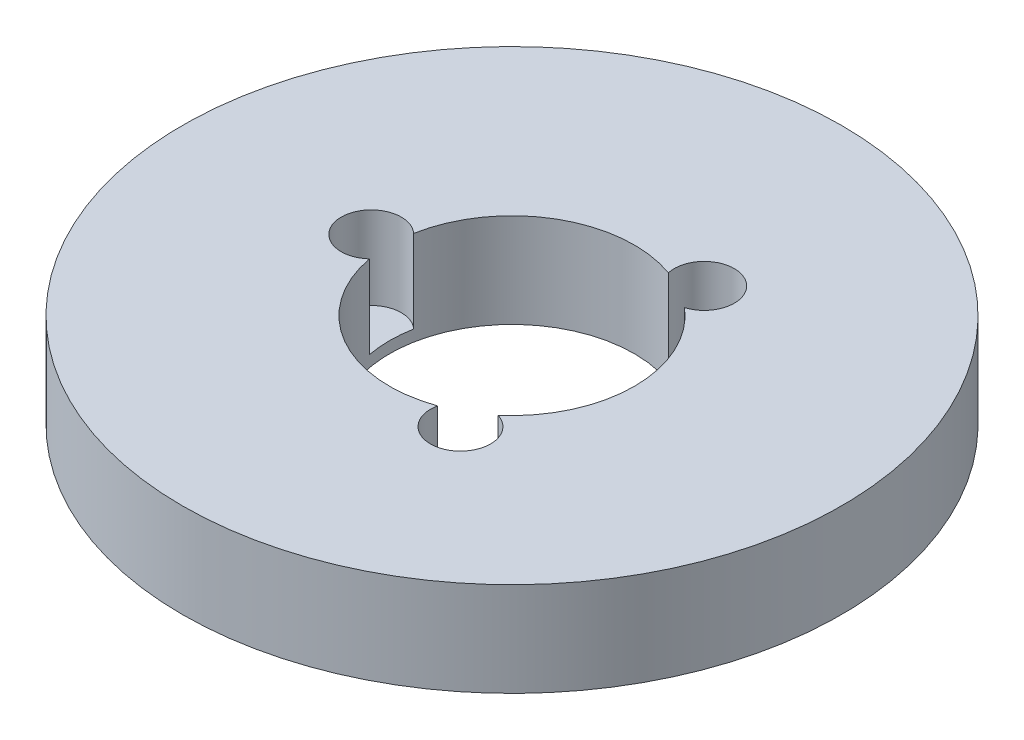
ISO-10303-21;
HEADER;
FILE_DESCRIPTION(('STEP AP214'),'2;1');
FILE_NAME('part.step','',(''),(''),'','','');
FILE_SCHEMA(('AUTOMOTIVE_DESIGN { 1 0 10303 214 1 1 1 1 }'));
ENDSEC;
DATA;
#1=APPLICATION_CONTEXT('core data for automotive mechanical design processes');
#2=APPLICATION_PROTOCOL_DEFINITION('international standard','automotive_design',2000,#1);
#3=PRODUCT_CONTEXT('',#1,'mechanical');
#4=PRODUCT('Part','Part','',(#3));
#5=PRODUCT_RELATED_PRODUCT_CATEGORY('part','',(#4));
#6=PRODUCT_DEFINITION_FORMATION('','',#4);
#7=PRODUCT_DEFINITION_CONTEXT('part definition',#1,'design');
#8=PRODUCT_DEFINITION('design','',#6,#7);
#9=PRODUCT_DEFINITION_SHAPE('','',#8);
#10=(LENGTH_UNIT() NAMED_UNIT(*) SI_UNIT(.MILLI.,.METRE.));
#11=(NAMED_UNIT(*) PLANE_ANGLE_UNIT() SI_UNIT($,.RADIAN.));
#12=(NAMED_UNIT(*) SI_UNIT($,.STERADIAN.) SOLID_ANGLE_UNIT());
#13=UNCERTAINTY_MEASURE_WITH_UNIT(LENGTH_MEASURE(1.E-05),#10,'distance_accuracy_value','');
#14=(GEOMETRIC_REPRESENTATION_CONTEXT(3) GLOBAL_UNCERTAINTY_ASSIGNED_CONTEXT((#13)) GLOBAL_UNIT_ASSIGNED_CONTEXT((#10,
#11,#12)) REPRESENTATION_CONTEXT('',''));
#15=CARTESIAN_POINT('',(0.,0.,0.));
#16=DIRECTION('',(0.,0.,1.));
#17=DIRECTION('',(1.,0.,0.));
#18=AXIS2_PLACEMENT_3D('',#15,#16,#17);
#19=CARTESIAN_POINT('',(0.,25.,0.));
#20=DIRECTION('',(0.,-1.,0.));
#21=DIRECTION('',(0.,0.,-1.));
#22=AXIS2_PLACEMENT_3D('',#19,#20,#21);
#23=CYLINDRICAL_SURFACE('',#22,87.5);
#24=CARTESIAN_POINT('',(0.,25.,0.));
#25=DIRECTION('',(0.,1.,0.));
#26=DIRECTION('',(0.,0.,1.));
#27=AXIS2_PLACEMENT_3D('',#24,#25,#26);
#28=CIRCLE('',#27,87.5);
#29=CARTESIAN_POINT('',(0.,25.,87.5));
#30=VERTEX_POINT('',#29);
#31=EDGE_CURVE('E126',#30,#30,#28,.T.);
#32=ORIENTED_EDGE('',*,*,#31,.F.);
#33=EDGE_LOOP('',(#32));
#34=FACE_BOUND('',#33,.T.);
#35=CARTESIAN_POINT('',(0.,0.,0.));
#36=DIRECTION('',(0.,1.,0.));
#37=DIRECTION('',(0.,0.,1.));
#38=AXIS2_PLACEMENT_3D('',#35,#36,#37);
#39=CIRCLE('',#38,87.5);
#40=CARTESIAN_POINT('',(0.,0.,87.5));
#41=VERTEX_POINT('',#40);
#42=EDGE_CURVE('E124',#41,#41,#39,.T.);
#43=ORIENTED_EDGE('',*,*,#42,.T.);
#44=EDGE_LOOP('',(#43));
#45=FACE_BOUND('',#44,.T.);
#46=ADVANCED_FACE('F39',(#34,#45),#23,.T.);
#47=CARTESIAN_POINT('',(0.,25.,0.));
#48=DIRECTION('',(0.,1.,0.));
#49=DIRECTION('',(0.,0.,1.));
#50=AXIS2_PLACEMENT_3D('',#47,#48,#49);
#51=PLANE('',#50);
#52=CARTESIAN_POINT('',(18.6823153612524,25.,32.3587194087134));
#53=DIRECTION('',(0.,1.,0.));
#54=DIRECTION('',(0.866025403784436,0.,-0.500000000000004));
#55=AXIS2_PLACEMENT_3D('',#52,#53,#54);
#56=CIRCLE('',#55,7.97575677468322);
#57=CARTESIAN_POINT('',(10.8988194424919,25.,30.6180622306501));
#58=VERTEX_POINT('',#57);
#59=CARTESIAN_POINT('',(21.0666099851501,25.,24.7476856237826));
#60=VERTEX_POINT('',#59);
#61=EDGE_CURVE('E147',#58,#60,#56,.T.);
#62=ORIENTED_EDGE('',*,*,#61,.F.);
#63=CARTESIAN_POINT('',(0.,25.,0.));
#64=DIRECTION('',(0.,1.,0.));
#65=DIRECTION('',(0.,0.,1.));
#66=AXIS2_PLACEMENT_3D('',#63,#64,#65);
#67=CIRCLE('',#66,32.5);
#68=CARTESIAN_POINT('',(-31.9654294276417,25.,5.87037660686746));
#69=VERTEX_POINT('',#68);
#70=EDGE_CURVE('E118',#69,#58,#67,.T.);
#71=ORIENTED_EDGE('',*,*,#70,.F.);
#72=CARTESIAN_POINT('',(-37.3646307225046,25.,0.));
#73=DIRECTION('',(0.,1.,0.));
#74=DIRECTION('',(0.,0.,1.));
#75=AXIS2_PLACEMENT_3D('',#72,#73,#74);
#76=CIRCLE('',#75,7.97575677468322);
#77=CARTESIAN_POINT('',(-31.9654294276417,25.,-5.87037660686746));
#78=VERTEX_POINT('',#77);
#79=EDGE_CURVE('E113',#78,#69,#76,.T.);
#80=ORIENTED_EDGE('',*,*,#79,.F.);
#81=CARTESIAN_POINT('',(10.8988194424915,25.,-30.6180622306502));
#82=VERTEX_POINT('',#81);
#83=EDGE_CURVE('E106',#82,#78,#67,.T.);
#84=ORIENTED_EDGE('',*,*,#83,.F.);
#85=CARTESIAN_POINT('',(18.682315361252,25.,-32.3587194087136));
#86=DIRECTION('',(0.,1.,0.));
#87=DIRECTION('',(-0.866025403784443,0.,-0.499999999999992));
#88=AXIS2_PLACEMENT_3D('',#85,#86,#87);
#89=CIRCLE('',#88,7.97575677468322);
#90=CARTESIAN_POINT('',(21.0666099851497,25.,-24.7476856237829));
#91=VERTEX_POINT('',#90);
#92=EDGE_CURVE('E90',#91,#82,#89,.T.);
#93=ORIENTED_EDGE('',*,*,#92,.F.);
#94=EDGE_CURVE('E116',#60,#91,#67,.T.);
#95=ORIENTED_EDGE('',*,*,#94,.F.);
#96=EDGE_LOOP('',(#62,#71,#80,#84,#93,#95));
#97=FACE_BOUND('',#96,.T.);
#98=ORIENTED_EDGE('',*,*,#31,.T.);
#99=EDGE_LOOP('',(#98));
#100=FACE_BOUND('',#99,.T.);
#101=ADVANCED_FACE('F115',(#97,#100),#51,.T.);
#102=CARTESIAN_POINT('',(0.,0.,0.));
#103=DIRECTION('',(0.,1.,0.));
#104=DIRECTION('',(0.,0.,1.));
#105=AXIS2_PLACEMENT_3D('',#102,#103,#104);
#106=PLANE('',#105);
#107=CARTESIAN_POINT('',(0.,0.,0.));
#108=DIRECTION('',(0.,1.,0.));
#109=DIRECTION('',(0.,0.,1.));
#110=AXIS2_PLACEMENT_3D('',#107,#108,#109);
#111=CIRCLE('',#110,32.5);
#112=CARTESIAN_POINT('',(0.,0.,32.5));
#113=VERTEX_POINT('',#112);
#114=EDGE_CURVE('E120',#113,#113,#111,.T.);
#115=ORIENTED_EDGE('',*,*,#114,.T.);
#116=EDGE_LOOP('',(#115));
#117=FACE_BOUND('',#116,.T.);
#118=ORIENTED_EDGE('',*,*,#42,.F.);
#119=EDGE_LOOP('',(#118));
#120=FACE_BOUND('',#119,.T.);
#121=ADVANCED_FACE('F164',(#117,#120),#106,.F.);
#122=CARTESIAN_POINT('',(0.,25.,0.));
#123=DIRECTION('',(0.,-1.,0.));
#124=DIRECTION('',(0.,0.,-1.));
#125=AXIS2_PLACEMENT_3D('',#122,#123,#124);
#126=CYLINDRICAL_SURFACE('',#125,32.5);
#127=DIRECTION('',(0.,1.,0.));
#128=VECTOR('',#127,1.);
#129=CARTESIAN_POINT('',(10.8988194424919,14.0069978353091,30.6180622306501));
#130=LINE('',#129,#128);
#131=CARTESIAN_POINT('',(10.8988194424919,3.01399567061827,30.6180622306501));
#132=VERTEX_POINT('',#131);
#133=EDGE_CURVE('E11',#132,#58,#130,.T.);
#134=ORIENTED_EDGE('',*,*,#133,.F.);
#135=CARTESIAN_POINT('',(0.,3.01399567061827,0.));
#136=DIRECTION('',(0.,1.,0.));
#137=DIRECTION('',(0.,0.,1.));
#138=AXIS2_PLACEMENT_3D('',#135,#136,#137);
#139=CIRCLE('',#138,32.5);
#140=CARTESIAN_POINT('',(21.0666099851501,3.01399567061827,24.7476856237826));
#141=VERTEX_POINT('',#140);
#142=EDGE_CURVE('E144',#132,#141,#139,.T.);
#143=ORIENTED_EDGE('',*,*,#142,.T.);
#144=DIRECTION('',(0.,1.,0.));
#145=VECTOR('',#144,1.);
#146=CARTESIAN_POINT('',(21.0666099851501,14.0069978353091,24.7476856237826));
#147=LINE('',#146,#145);
#148=EDGE_CURVE('E46',#60,#141,#147,.F.);
#149=ORIENTED_EDGE('',*,*,#148,.F.);
#150=ORIENTED_EDGE('',*,*,#94,.T.);
#151=DIRECTION('',(0.,1.,0.));
#152=VECTOR('',#151,1.);
#153=CARTESIAN_POINT('',(21.0666099851498,14.0069978353091,-24.7476856237829));
#154=LINE('',#153,#152);
#155=CARTESIAN_POINT('',(21.0666099851497,3.01399567061827,-24.7476856237829));
#156=VERTEX_POINT('',#155);
#157=EDGE_CURVE('E92',#156,#91,#154,.T.);
#158=ORIENTED_EDGE('',*,*,#157,.F.);
#159=CARTESIAN_POINT('',(0.,3.01399567061827,0.));
#160=DIRECTION('',(0.,1.,0.));
#161=DIRECTION('',(0.,0.,1.));
#162=AXIS2_PLACEMENT_3D('',#159,#160,#161);
#163=CIRCLE('',#162,32.5);
#164=CARTESIAN_POINT('',(10.8988194424915,3.01399567061827,-30.6180622306502));
#165=VERTEX_POINT('',#164);
#166=EDGE_CURVE('E107',#156,#165,#163,.T.);
#167=ORIENTED_EDGE('',*,*,#166,.T.);
#168=DIRECTION('',(0.,1.,0.));
#169=VECTOR('',#168,1.);
#170=CARTESIAN_POINT('',(10.8988194424915,14.0069978353091,-30.6180622306502));
#171=LINE('',#170,#169);
#172=EDGE_CURVE('E95',#82,#165,#171,.F.);
#173=ORIENTED_EDGE('',*,*,#172,.F.);
#174=ORIENTED_EDGE('',*,*,#83,.T.);
#175=DIRECTION('',(0.,1.,0.));
#176=VECTOR('',#175,1.);
#177=CARTESIAN_POINT('',(-31.9654294276417,14.0069978353091,-5.87037660686745));
#178=LINE('',#177,#176);
#179=CARTESIAN_POINT('',(-31.9654294276417,3.01399567061827,-5.87037660686746));
#180=VERTEX_POINT('',#179);
#181=EDGE_CURVE('E143',#180,#78,#178,.T.);
#182=ORIENTED_EDGE('',*,*,#181,.F.);
#183=CARTESIAN_POINT('',(0.,3.01399567061827,0.));
#184=DIRECTION('',(0.,1.,0.));
#185=DIRECTION('',(0.,0.,1.));
#186=AXIS2_PLACEMENT_3D('',#183,#184,#185);
#187=CIRCLE('',#186,32.5);
#188=CARTESIAN_POINT('',(-31.9654294276417,3.01399567061827,5.87037660686746));
#189=VERTEX_POINT('',#188);
#190=EDGE_CURVE('E132',#180,#189,#187,.T.);
#191=ORIENTED_EDGE('',*,*,#190,.T.);
#192=DIRECTION('',(0.,1.,0.));
#193=VECTOR('',#192,1.);
#194=CARTESIAN_POINT('',(-31.9654294276417,14.0069978353091,5.87037660686745));
#195=LINE('',#194,#193);
#196=EDGE_CURVE('E137',#69,#189,#195,.F.);
#197=ORIENTED_EDGE('',*,*,#196,.F.);
#198=ORIENTED_EDGE('',*,*,#70,.T.);
#199=EDGE_LOOP('',(#134,#143,#149,#150,#158,#167,#173,#174,#182,#191,#197,#198));
#200=FACE_BOUND('',#199,.T.);
#201=ORIENTED_EDGE('',*,*,#114,.F.);
#202=EDGE_LOOP('',(#201));
#203=FACE_BOUND('',#202,.T.);
#204=ADVANCED_FACE('F103',(#200,#203),#126,.F.);
#205=CARTESIAN_POINT('',(-37.3646307225046,3.01399567061827,0.));
#206=DIRECTION('',(0.,1.,0.));
#207=DIRECTION('',(0.,0.,1.));
#208=AXIS2_PLACEMENT_3D('',#205,#206,#207);
#209=CYLINDRICAL_SURFACE('',#208,7.97575677468322);
#210=ORIENTED_EDGE('',*,*,#181,.T.);
#211=ORIENTED_EDGE('',*,*,#79,.T.);
#212=ORIENTED_EDGE('',*,*,#196,.T.);
#213=CARTESIAN_POINT('',(-37.3646307225046,3.01399567061827,0.));
#214=DIRECTION('',(0.,1.,0.));
#215=DIRECTION('',(0.,0.,1.));
#216=AXIS2_PLACEMENT_3D('',#213,#214,#215);
#217=CIRCLE('',#216,7.97575677468322);
#218=EDGE_CURVE('E121',#180,#189,#217,.T.);
#219=ORIENTED_EDGE('',*,*,#218,.F.);
#220=EDGE_LOOP('',(#210,#211,#212,#219));
#221=FACE_BOUND('',#220,.T.);
#222=ADVANCED_FACE('F174',(#221),#209,.F.);
#223=CARTESIAN_POINT('',(-37.3646307225046,3.01399567061827,0.));
#224=DIRECTION('',(0.,1.,0.));
#225=DIRECTION('',(0.,0.,1.));
#226=AXIS2_PLACEMENT_3D('',#223,#224,#225);
#227=PLANE('',#226);
#228=ORIENTED_EDGE('',*,*,#218,.T.);
#229=ORIENTED_EDGE('',*,*,#190,.F.);
#230=EDGE_LOOP('',(#228,#229));
#231=FACE_BOUND('',#230,.T.);
#232=ADVANCED_FACE('F177',(#231),#227,.T.);
#233=CARTESIAN_POINT('',(18.682315361252,3.01399567061827,-32.3587194087136));
#234=DIRECTION('',(0.,1.,0.));
#235=DIRECTION('',(0.,0.,1.));
#236=AXIS2_PLACEMENT_3D('',#233,#234,#235);
#237=CYLINDRICAL_SURFACE('',#236,7.97575677468322);
#238=ORIENTED_EDGE('',*,*,#157,.T.);
#239=ORIENTED_EDGE('',*,*,#92,.T.);
#240=ORIENTED_EDGE('',*,*,#172,.T.);
#241=CARTESIAN_POINT('',(18.682315361252,3.01399567061827,-32.3587194087136));
#242=DIRECTION('',(0.,1.,0.));
#243=DIRECTION('',(-0.866025403784443,0.,-0.499999999999992));
#244=AXIS2_PLACEMENT_3D('',#241,#242,#243);
#245=CIRCLE('',#244,7.97575677468322);
#246=EDGE_CURVE('E56',#156,#165,#245,.T.);
#247=ORIENTED_EDGE('',*,*,#246,.F.);
#248=EDGE_LOOP('',(#238,#239,#240,#247));
#249=FACE_BOUND('',#248,.T.);
#250=ADVANCED_FACE('F93',(#249),#237,.F.);
#251=CARTESIAN_POINT('',(18.682315361252,3.01399567061827,-32.3587194087136));
#252=DIRECTION('',(0.,1.,0.));
#253=DIRECTION('',(-0.866025403784443,0.,-0.499999999999992));
#254=AXIS2_PLACEMENT_3D('',#251,#252,#253);
#255=PLANE('',#254);
#256=ORIENTED_EDGE('',*,*,#246,.T.);
#257=ORIENTED_EDGE('',*,*,#166,.F.);
#258=EDGE_LOOP('',(#256,#257));
#259=FACE_BOUND('',#258,.T.);
#260=ADVANCED_FACE('F160',(#259),#255,.T.);
#261=CARTESIAN_POINT('',(18.6823153612524,3.01399567061827,32.3587194087134));
#262=DIRECTION('',(0.,1.,0.));
#263=DIRECTION('',(0.,0.,1.));
#264=AXIS2_PLACEMENT_3D('',#261,#262,#263);
#265=CYLINDRICAL_SURFACE('',#264,7.97575677468322);
#266=ORIENTED_EDGE('',*,*,#133,.T.);
#267=ORIENTED_EDGE('',*,*,#61,.T.);
#268=ORIENTED_EDGE('',*,*,#148,.T.);
#269=CARTESIAN_POINT('',(18.6823153612524,3.01399567061827,32.3587194087134));
#270=DIRECTION('',(0.,1.,0.));
#271=DIRECTION('',(0.866025403784436,0.,-0.500000000000004));
#272=AXIS2_PLACEMENT_3D('',#269,#270,#271);
#273=CIRCLE('',#272,7.97575677468322);
#274=EDGE_CURVE('E55',#132,#141,#273,.T.);
#275=ORIENTED_EDGE('',*,*,#274,.F.);
#276=EDGE_LOOP('',(#266,#267,#268,#275));
#277=FACE_BOUND('',#276,.T.);
#278=ADVANCED_FACE('F149',(#277),#265,.F.);
#279=CARTESIAN_POINT('',(18.6823153612524,3.01399567061827,32.3587194087134));
#280=DIRECTION('',(0.,1.,0.));
#281=DIRECTION('',(0.866025403784436,0.,-0.500000000000004));
#282=AXIS2_PLACEMENT_3D('',#279,#280,#281);
#283=PLANE('',#282);
#284=ORIENTED_EDGE('',*,*,#274,.T.);
#285=ORIENTED_EDGE('',*,*,#142,.F.);
#286=EDGE_LOOP('',(#284,#285));
#287=FACE_BOUND('',#286,.T.);
#288=ADVANCED_FACE('F151',(#287),#283,.T.);
#289=CLOSED_SHELL('',(#46,#101,#121,#204,#222,#232,#250,#260,#278,#288));
#290=MANIFOLD_SOLID_BREP('B2',#289);
#291=ADVANCED_BREP_SHAPE_REPRESENTATION('',(#18,#290),#14);
#292=SHAPE_DEFINITION_REPRESENTATION(#9,#291);
ENDSEC;
END-ISO-10303-21;
